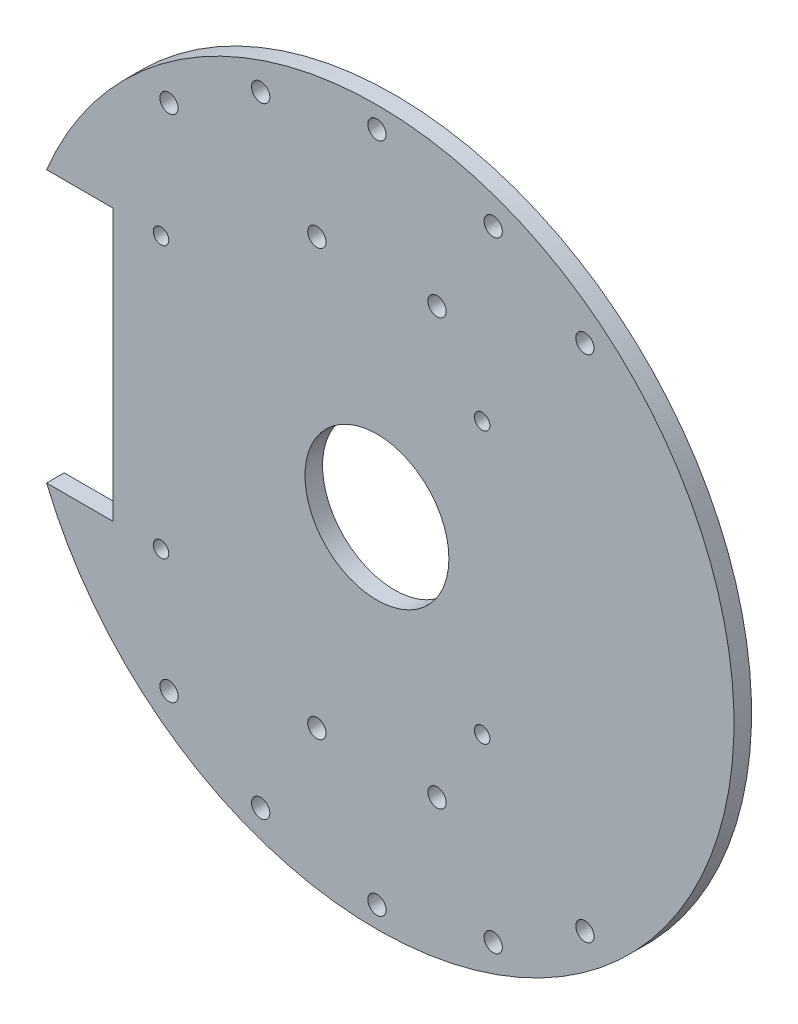
ISO-10303-21;
HEADER;
FILE_DESCRIPTION(('STEP AP214'),'2;1');
FILE_NAME('part.step','',(''),(''),'','','');
FILE_SCHEMA(('AUTOMOTIVE_DESIGN { 1 0 10303 214 1 1 1 1 }'));
ENDSEC;
DATA;
#1=APPLICATION_CONTEXT('core data for automotive mechanical design processes');
#2=APPLICATION_PROTOCOL_DEFINITION('international standard','automotive_design',2000,#1);
#3=PRODUCT_CONTEXT('',#1,'mechanical');
#4=PRODUCT('Part','Part','',(#3));
#5=PRODUCT_RELATED_PRODUCT_CATEGORY('part','',(#4));
#6=PRODUCT_DEFINITION_FORMATION('','',#4);
#7=PRODUCT_DEFINITION_CONTEXT('part definition',#1,'design');
#8=PRODUCT_DEFINITION('design','',#6,#7);
#9=PRODUCT_DEFINITION_SHAPE('','',#8);
#10=(LENGTH_UNIT() NAMED_UNIT(*) SI_UNIT(.MILLI.,.METRE.));
#11=(NAMED_UNIT(*) PLANE_ANGLE_UNIT() SI_UNIT($,.RADIAN.));
#12=(NAMED_UNIT(*) SI_UNIT($,.STERADIAN.) SOLID_ANGLE_UNIT());
#13=UNCERTAINTY_MEASURE_WITH_UNIT(LENGTH_MEASURE(1.E-05),#10,'distance_accuracy_value','');
#14=(GEOMETRIC_REPRESENTATION_CONTEXT(3) GLOBAL_UNCERTAINTY_ASSIGNED_CONTEXT((#13)) GLOBAL_UNIT_ASSIGNED_CONTEXT((#10,
#11,#12)) REPRESENTATION_CONTEXT('',''));
#15=CARTESIAN_POINT('',(0.,0.,0.));
#16=DIRECTION('',(0.,0.,1.));
#17=DIRECTION('',(1.,0.,0.));
#18=AXIS2_PLACEMENT_3D('',#15,#16,#17);
#19=CARTESIAN_POINT('',(-15.1685965380731,-0.366425757688035,3.175));
#20=DIRECTION('',(0.,0.,1.));
#21=DIRECTION('',(1.,0.,0.));
#22=AXIS2_PLACEMENT_3D('',#19,#20,#21);
#23=PLANE('',#22);
#24=DIRECTION('',(-1.,0.,0.));
#25=VECTOR('',#24,1.);
#26=CARTESIAN_POINT('',(-74.8343320987782,24.1335742423121,3.175));
#27=LINE('',#26,#25);
#28=CARTESIAN_POINT('',(-62.8343320987782,24.1335742423121,3.175));
#29=VERTEX_POINT('',#28);
#30=CARTESIAN_POINT('',(-74.8343320987782,24.1335742423121,3.175));
#31=VERTEX_POINT('',#30);
#32=EDGE_CURVE('E73',#29,#31,#27,.T.);
#33=ORIENTED_EDGE('',*,*,#32,.F.);
#34=DIRECTION('',(0.,1.,0.));
#35=VECTOR('',#34,1.);
#36=CARTESIAN_POINT('',(-62.8343320987782,24.1335742423121,3.175));
#37=LINE('',#36,#35);
#38=CARTESIAN_POINT('',(-62.8343320987782,-24.8664257576879,3.175));
#39=VERTEX_POINT('',#38);
#40=EDGE_CURVE('E97',#39,#29,#37,.T.);
#41=ORIENTED_EDGE('',*,*,#40,.F.);
#42=DIRECTION('',(1.,0.,0.));
#43=VECTOR('',#42,1.);
#44=CARTESIAN_POINT('',(-62.8343320987782,-24.8664257576879,3.175));
#45=LINE('',#44,#43);
#46=CARTESIAN_POINT('',(-74.8343320987784,-24.8664257576879,3.175));
#47=VERTEX_POINT('',#46);
#48=EDGE_CURVE('E79',#47,#39,#45,.T.);
#49=ORIENTED_EDGE('',*,*,#48,.F.);
#50=CARTESIAN_POINT('',(-15.1685965380731,-0.366425757688035,3.175));
#51=DIRECTION('',(0.,0.,1.));
#52=DIRECTION('',(1.,0.,0.));
#53=AXIS2_PLACEMENT_3D('',#50,#51,#52);
#54=CIRCLE('',#53,64.5);
#55=EDGE_CURVE('E11',#47,#31,#54,.T.);
#56=ORIENTED_EDGE('',*,*,#55,.T.);
#57=EDGE_LOOP('',(#33,#41,#49,#56));
#58=FACE_BOUND('',#57,.T.);
#59=CARTESIAN_POINT('',(5.83140346192693,55.633574242312,3.175));
#60=DIRECTION('',(0.,0.,1.));
#61=DIRECTION('',(-1.,0.,0.));
#62=AXIS2_PLACEMENT_3D('',#59,#60,#61);
#63=CIRCLE('',#62,1.65);
#64=CARTESIAN_POINT('',(4.18140346192693,55.633574242312,3.175));
#65=VERTEX_POINT('',#64);
#66=EDGE_CURVE('E113',#65,#65,#63,.T.);
#67=ORIENTED_EDGE('',*,*,#66,.F.);
#68=EDGE_LOOP('',(#67));
#69=FACE_BOUND('',#68,.T.);
#70=CARTESIAN_POINT('',(-52.7320677335862,45.6335742423119,3.175));
#71=DIRECTION('',(0.,0.,1.));
#72=DIRECTION('',(1.,0.,0.));
#73=AXIS2_PLACEMENT_3D('',#70,#71,#72);
#74=CIRCLE('',#73,1.65);
#75=CARTESIAN_POINT('',(-51.0820677335862,45.6335742423119,3.175));
#76=VERTEX_POINT('',#75);
#77=EDGE_CURVE('E125',#76,#76,#74,.T.);
#78=ORIENTED_EDGE('',*,*,#77,.F.);
#79=EDGE_LOOP('',(#78));
#80=FACE_BOUND('',#79,.T.);
#81=CARTESIAN_POINT('',(-4.31859653807309,38.058574242312,3.175));
#82=DIRECTION('',(0.,0.,1.));
#83=DIRECTION('',(-1.,0.,0.));
#84=AXIS2_PLACEMENT_3D('',#81,#82,#83);
#85=CIRCLE('',#84,1.65);
#86=CARTESIAN_POINT('',(-5.96859653807309,38.058574242312,3.175));
#87=VERTEX_POINT('',#86);
#88=EDGE_CURVE('E137',#87,#87,#85,.T.);
#89=ORIENTED_EDGE('',*,*,#88,.F.);
#90=EDGE_LOOP('',(#89));
#91=FACE_BOUND('',#90,.T.);
#92=CARTESIAN_POINT('',(-15.1685965380731,60.2835742423119,3.175));
#93=DIRECTION('',(0.,0.,1.));
#94=DIRECTION('',(-1.,0.,0.));
#95=AXIS2_PLACEMENT_3D('',#92,#93,#94);
#96=CIRCLE('',#95,1.65);
#97=CARTESIAN_POINT('',(-16.8185965380731,60.2835742423119,3.175));
#98=VERTEX_POINT('',#97);
#99=EDGE_CURVE('E149',#98,#98,#96,.T.);
#100=ORIENTED_EDGE('',*,*,#99,.F.);
#101=EDGE_LOOP('',(#100));
#102=FACE_BOUND('',#101,.T.);
#103=CARTESIAN_POINT('',(3.83140346192678,24.1335742423121,3.175));
#104=DIRECTION('',(0.,0.,1.));
#105=DIRECTION('',(1.,0.,0.));
#106=AXIS2_PLACEMENT_3D('',#103,#104,#105);
#107=CIRCLE('',#106,1.4);
#108=CARTESIAN_POINT('',(5.23140346192678,24.1335742423121,3.175));
#109=VERTEX_POINT('',#108);
#110=EDGE_CURVE('E161',#109,#109,#107,.T.);
#111=ORIENTED_EDGE('',*,*,#110,.F.);
#112=EDGE_LOOP('',(#111));
#113=FACE_BOUND('',#112,.T.);
#114=CARTESIAN_POINT('',(-36.1685965380731,-56.366425757688,3.175));
#115=DIRECTION('',(0.,0.,1.));
#116=DIRECTION('',(-1.,0.,0.));
#117=AXIS2_PLACEMENT_3D('',#114,#115,#116);
#118=CIRCLE('',#117,1.65);
#119=CARTESIAN_POINT('',(-37.8185965380731,-56.366425757688,3.175));
#120=VERTEX_POINT('',#119);
#121=EDGE_CURVE('E173',#120,#120,#118,.T.);
#122=ORIENTED_EDGE('',*,*,#121,.F.);
#123=EDGE_LOOP('',(#122));
#124=FACE_BOUND('',#123,.T.);
#125=CARTESIAN_POINT('',(-54.1685965380731,-24.8664257576881,3.175));
#126=DIRECTION('',(0.,0.,1.));
#127=DIRECTION('',(1.,0.,0.));
#128=AXIS2_PLACEMENT_3D('',#125,#126,#127);
#129=CIRCLE('',#128,1.4);
#130=CARTESIAN_POINT('',(-52.7685965380731,-24.8664257576881,3.175));
#131=VERTEX_POINT('',#130);
#132=EDGE_CURVE('E185',#131,#131,#129,.T.);
#133=ORIENTED_EDGE('',*,*,#132,.F.);
#134=EDGE_LOOP('',(#133));
#135=FACE_BOUND('',#134,.T.);
#136=CARTESIAN_POINT('',(-54.1685965380731,24.1335742423121,3.175));
#137=DIRECTION('',(0.,0.,1.));
#138=DIRECTION('',(1.,0.,0.));
#139=AXIS2_PLACEMENT_3D('',#136,#137,#138);
#140=CIRCLE('',#139,1.4);
#141=CARTESIAN_POINT('',(-52.7685965380731,24.1335742423121,3.175));
#142=VERTEX_POINT('',#141);
#143=EDGE_CURVE('E197',#142,#142,#140,.T.);
#144=ORIENTED_EDGE('',*,*,#143,.F.);
#145=EDGE_LOOP('',(#144));
#146=FACE_BOUND('',#145,.T.);
#147=CARTESIAN_POINT('',(-4.31859653807308,-38.7914257576881,3.175));
#148=DIRECTION('',(0.,0.,1.));
#149=DIRECTION('',(1.,0.,0.));
#150=AXIS2_PLACEMENT_3D('',#147,#148,#149);
#151=CIRCLE('',#150,1.65);
#152=CARTESIAN_POINT('',(-2.66859653807308,-38.7914257576881,3.175));
#153=VERTEX_POINT('',#152);
#154=EDGE_CURVE('E209',#153,#153,#151,.T.);
#155=ORIENTED_EDGE('',*,*,#154,.F.);
#156=EDGE_LOOP('',(#155));
#157=FACE_BOUND('',#156,.T.);
#158=CARTESIAN_POINT('',(-15.1685965380731,-0.366425757688035,3.175));
#159=DIRECTION('',(0.,0.,1.));
#160=DIRECTION('',(1.,0.,0.));
#161=AXIS2_PLACEMENT_3D('',#158,#159,#160);
#162=CIRCLE('',#161,13.);
#163=CARTESIAN_POINT('',(-2.16859653807308,-0.366425757688035,3.175));
#164=VERTEX_POINT('',#163);
#165=EDGE_CURVE('E215',#164,#164,#162,.T.);
#166=ORIENTED_EDGE('',*,*,#165,.F.);
#167=EDGE_LOOP('',(#166));
#168=FACE_BOUND('',#167,.T.);
#169=CARTESIAN_POINT('',(-15.1685965380731,-61.016425757688,3.175));
#170=DIRECTION('',(0.,0.,1.));
#171=DIRECTION('',(1.,0.,0.));
#172=AXIS2_PLACEMENT_3D('',#169,#170,#171);
#173=CIRCLE('',#172,1.65);
#174=CARTESIAN_POINT('',(-13.5185965380731,-61.016425757688,3.175));
#175=VERTEX_POINT('',#174);
#176=EDGE_CURVE('E203',#175,#175,#173,.T.);
#177=ORIENTED_EDGE('',*,*,#176,.F.);
#178=EDGE_LOOP('',(#177));
#179=FACE_BOUND('',#178,.T.);
#180=CARTESIAN_POINT('',(22.3948746574401,-46.366425757688,3.175));
#181=DIRECTION('',(0.,0.,1.));
#182=DIRECTION('',(1.,0.,0.));
#183=AXIS2_PLACEMENT_3D('',#180,#181,#182);
#184=CIRCLE('',#183,1.65);
#185=CARTESIAN_POINT('',(24.0448746574401,-46.366425757688,3.175));
#186=VERTEX_POINT('',#185);
#187=EDGE_CURVE('E191',#186,#186,#184,.T.);
#188=ORIENTED_EDGE('',*,*,#187,.F.);
#189=EDGE_LOOP('',(#188));
#190=FACE_BOUND('',#189,.T.);
#191=CARTESIAN_POINT('',(-26.0185965380731,-38.791425757688,3.175));
#192=DIRECTION('',(0.,0.,1.));
#193=DIRECTION('',(1.,0.,0.));
#194=AXIS2_PLACEMENT_3D('',#191,#192,#193);
#195=CIRCLE('',#194,1.65000000000001);
#196=CARTESIAN_POINT('',(-24.3685965380731,-38.791425757688,3.175));
#197=VERTEX_POINT('',#196);
#198=EDGE_CURVE('E179',#197,#197,#195,.T.);
#199=ORIENTED_EDGE('',*,*,#198,.F.);
#200=EDGE_LOOP('',(#199));
#201=FACE_BOUND('',#200,.T.);
#202=CARTESIAN_POINT('',(-52.7320677335862,-46.366425757688,3.175));
#203=DIRECTION('',(0.,0.,1.));
#204=DIRECTION('',(-1.,0.,0.));
#205=AXIS2_PLACEMENT_3D('',#202,#203,#204);
#206=CIRCLE('',#205,1.65);
#207=CARTESIAN_POINT('',(-54.3820677335862,-46.366425757688,3.175));
#208=VERTEX_POINT('',#207);
#209=EDGE_CURVE('E167',#208,#208,#206,.T.);
#210=ORIENTED_EDGE('',*,*,#209,.F.);
#211=EDGE_LOOP('',(#210));
#212=FACE_BOUND('',#211,.T.);
#213=CARTESIAN_POINT('',(3.83140346192679,-24.8664257576881,3.175));
#214=DIRECTION('',(0.,0.,1.));
#215=DIRECTION('',(1.,0.,0.));
#216=AXIS2_PLACEMENT_3D('',#213,#214,#215);
#217=CIRCLE('',#216,1.4);
#218=CARTESIAN_POINT('',(5.23140346192678,-24.8664257576881,3.175));
#219=VERTEX_POINT('',#218);
#220=EDGE_CURVE('E155',#219,#219,#217,.T.);
#221=ORIENTED_EDGE('',*,*,#220,.F.);
#222=EDGE_LOOP('',(#221));
#223=FACE_BOUND('',#222,.T.);
#224=CARTESIAN_POINT('',(-26.0185965380731,38.0585742423119,3.175));
#225=DIRECTION('',(0.,0.,1.));
#226=DIRECTION('',(-1.,0.,0.));
#227=AXIS2_PLACEMENT_3D('',#224,#225,#226);
#228=CIRCLE('',#227,1.65000000000001);
#229=CARTESIAN_POINT('',(-27.6685965380731,38.0585742423119,3.175));
#230=VERTEX_POINT('',#229);
#231=EDGE_CURVE('E143',#230,#230,#228,.T.);
#232=ORIENTED_EDGE('',*,*,#231,.F.);
#233=EDGE_LOOP('',(#232));
#234=FACE_BOUND('',#233,.T.);
#235=CARTESIAN_POINT('',(5.83140346192694,-56.366425757688,3.175));
#236=DIRECTION('',(0.,0.,1.));
#237=DIRECTION('',(1.,0.,0.));
#238=AXIS2_PLACEMENT_3D('',#235,#236,#237);
#239=CIRCLE('',#238,1.65);
#240=CARTESIAN_POINT('',(7.48140346192694,-56.366425757688,3.175));
#241=VERTEX_POINT('',#240);
#242=EDGE_CURVE('E131',#241,#241,#239,.T.);
#243=ORIENTED_EDGE('',*,*,#242,.F.);
#244=EDGE_LOOP('',(#243));
#245=FACE_BOUND('',#244,.T.);
#246=CARTESIAN_POINT('',(-36.1685965380731,55.633574242312,3.175));
#247=DIRECTION('',(0.,0.,1.));
#248=DIRECTION('',(1.,0.,0.));
#249=AXIS2_PLACEMENT_3D('',#246,#247,#248);
#250=CIRCLE('',#249,1.65);
#251=CARTESIAN_POINT('',(-34.5185965380731,55.633574242312,3.175));
#252=VERTEX_POINT('',#251);
#253=EDGE_CURVE('E119',#252,#252,#250,.T.);
#254=ORIENTED_EDGE('',*,*,#253,.F.);
#255=EDGE_LOOP('',(#254));
#256=FACE_BOUND('',#255,.T.);
#257=CARTESIAN_POINT('',(22.39487465744,45.633574242312,3.175));
#258=DIRECTION('',(0.,0.,1.));
#259=DIRECTION('',(-1.,0.,0.));
#260=AXIS2_PLACEMENT_3D('',#257,#258,#259);
#261=CIRCLE('',#260,1.65);
#262=CARTESIAN_POINT('',(20.74487465744,45.633574242312,3.175));
#263=VERTEX_POINT('',#262);
#264=EDGE_CURVE('E107',#263,#263,#261,.T.);
#265=ORIENTED_EDGE('',*,*,#264,.F.);
#266=EDGE_LOOP('',(#265));
#267=FACE_BOUND('',#266,.T.);
#268=ADVANCED_FACE('F33',(#58,#69,#80,#91,#102,#113,#124,#135,#146,#157,#168,#179,#190,#201,
#212,#223,#234,#245,#256,#267),#23,.T.);
#269=CARTESIAN_POINT('',(-15.1685965380731,-0.366425757688035,0.));
#270=DIRECTION('',(0.,0.,1.));
#271=DIRECTION('',(1.,0.,0.));
#272=AXIS2_PLACEMENT_3D('',#269,#270,#271);
#273=PLANE('',#272);
#274=DIRECTION('',(0.,1.,0.));
#275=VECTOR('',#274,1.);
#276=CARTESIAN_POINT('',(-62.8343320987782,24.1335742423121,0.));
#277=LINE('',#276,#275);
#278=CARTESIAN_POINT('',(-62.8343320987782,-24.8664257576879,0.));
#279=VERTEX_POINT('',#278);
#280=CARTESIAN_POINT('',(-62.8343320987782,24.1335742423121,0.));
#281=VERTEX_POINT('',#280);
#282=EDGE_CURVE('E87',#279,#281,#277,.T.);
#283=ORIENTED_EDGE('',*,*,#282,.T.);
#284=DIRECTION('',(-1.,0.,0.));
#285=VECTOR('',#284,1.);
#286=CARTESIAN_POINT('',(-74.8343320987782,24.1335742423121,0.));
#287=LINE('',#286,#285);
#288=CARTESIAN_POINT('',(-74.8343320987782,24.1335742423121,0.));
#289=VERTEX_POINT('',#288);
#290=EDGE_CURVE('E90',#281,#289,#287,.T.);
#291=ORIENTED_EDGE('',*,*,#290,.T.);
#292=CARTESIAN_POINT('',(-15.1685965380731,-0.366425757688035,0.));
#293=DIRECTION('',(0.,0.,1.));
#294=DIRECTION('',(1.,0.,0.));
#295=AXIS2_PLACEMENT_3D('',#292,#293,#294);
#296=CIRCLE('',#295,64.5);
#297=CARTESIAN_POINT('',(-74.8343320987784,-24.8664257576879,0.));
#298=VERTEX_POINT('',#297);
#299=EDGE_CURVE('E37',#298,#289,#296,.T.);
#300=ORIENTED_EDGE('',*,*,#299,.F.);
#301=DIRECTION('',(1.,0.,0.));
#302=VECTOR('',#301,1.);
#303=CARTESIAN_POINT('',(-62.8343320987782,-24.8664257576879,0.));
#304=LINE('',#303,#302);
#305=EDGE_CURVE('E48',#298,#279,#304,.T.);
#306=ORIENTED_EDGE('',*,*,#305,.T.);
#307=EDGE_LOOP('',(#283,#291,#300,#306));
#308=FACE_BOUND('',#307,.T.);
#309=CARTESIAN_POINT('',(-15.1685965380731,-0.366425757688035,0.));
#310=DIRECTION('',(0.,0.,1.));
#311=DIRECTION('',(1.,0.,0.));
#312=AXIS2_PLACEMENT_3D('',#309,#310,#311);
#313=CIRCLE('',#312,13.);
#314=CARTESIAN_POINT('',(-2.16859653807308,-0.366425757688035,0.));
#315=VERTEX_POINT('',#314);
#316=EDGE_CURVE('E212',#315,#315,#313,.T.);
#317=ORIENTED_EDGE('',*,*,#316,.T.);
#318=EDGE_LOOP('',(#317));
#319=FACE_BOUND('',#318,.T.);
#320=CARTESIAN_POINT('',(-4.31859653807308,-38.7914257576881,0.));
#321=DIRECTION('',(0.,0.,1.));
#322=DIRECTION('',(1.,0.,0.));
#323=AXIS2_PLACEMENT_3D('',#320,#321,#322);
#324=CIRCLE('',#323,1.65);
#325=CARTESIAN_POINT('',(-2.66859653807308,-38.7914257576881,0.));
#326=VERTEX_POINT('',#325);
#327=EDGE_CURVE('E206',#326,#326,#324,.T.);
#328=ORIENTED_EDGE('',*,*,#327,.T.);
#329=EDGE_LOOP('',(#328));
#330=FACE_BOUND('',#329,.T.);
#331=CARTESIAN_POINT('',(-15.1685965380731,-61.016425757688,0.));
#332=DIRECTION('',(0.,0.,1.));
#333=DIRECTION('',(1.,0.,0.));
#334=AXIS2_PLACEMENT_3D('',#331,#332,#333);
#335=CIRCLE('',#334,1.65);
#336=CARTESIAN_POINT('',(-13.5185965380731,-61.016425757688,0.));
#337=VERTEX_POINT('',#336);
#338=EDGE_CURVE('E200',#337,#337,#335,.T.);
#339=ORIENTED_EDGE('',*,*,#338,.T.);
#340=EDGE_LOOP('',(#339));
#341=FACE_BOUND('',#340,.T.);
#342=CARTESIAN_POINT('',(-54.1685965380731,24.1335742423121,0.));
#343=DIRECTION('',(0.,0.,1.));
#344=DIRECTION('',(1.,0.,0.));
#345=AXIS2_PLACEMENT_3D('',#342,#343,#344);
#346=CIRCLE('',#345,1.4);
#347=CARTESIAN_POINT('',(-52.7685965380731,24.1335742423121,0.));
#348=VERTEX_POINT('',#347);
#349=EDGE_CURVE('E194',#348,#348,#346,.T.);
#350=ORIENTED_EDGE('',*,*,#349,.T.);
#351=EDGE_LOOP('',(#350));
#352=FACE_BOUND('',#351,.T.);
#353=CARTESIAN_POINT('',(22.3948746574401,-46.366425757688,0.));
#354=DIRECTION('',(0.,0.,1.));
#355=DIRECTION('',(1.,0.,0.));
#356=AXIS2_PLACEMENT_3D('',#353,#354,#355);
#357=CIRCLE('',#356,1.65);
#358=CARTESIAN_POINT('',(24.0448746574401,-46.366425757688,0.));
#359=VERTEX_POINT('',#358);
#360=EDGE_CURVE('E188',#359,#359,#357,.T.);
#361=ORIENTED_EDGE('',*,*,#360,.T.);
#362=EDGE_LOOP('',(#361));
#363=FACE_BOUND('',#362,.T.);
#364=CARTESIAN_POINT('',(-54.1685965380731,-24.8664257576881,0.));
#365=DIRECTION('',(0.,0.,1.));
#366=DIRECTION('',(1.,0.,0.));
#367=AXIS2_PLACEMENT_3D('',#364,#365,#366);
#368=CIRCLE('',#367,1.4);
#369=CARTESIAN_POINT('',(-52.7685965380731,-24.8664257576881,0.));
#370=VERTEX_POINT('',#369);
#371=EDGE_CURVE('E182',#370,#370,#368,.T.);
#372=ORIENTED_EDGE('',*,*,#371,.T.);
#373=EDGE_LOOP('',(#372));
#374=FACE_BOUND('',#373,.T.);
#375=CARTESIAN_POINT('',(-26.0185965380731,-38.791425757688,0.));
#376=DIRECTION('',(0.,0.,1.));
#377=DIRECTION('',(1.,0.,0.));
#378=AXIS2_PLACEMENT_3D('',#375,#376,#377);
#379=CIRCLE('',#378,1.65000000000001);
#380=CARTESIAN_POINT('',(-24.3685965380731,-38.791425757688,0.));
#381=VERTEX_POINT('',#380);
#382=EDGE_CURVE('E176',#381,#381,#379,.T.);
#383=ORIENTED_EDGE('',*,*,#382,.T.);
#384=EDGE_LOOP('',(#383));
#385=FACE_BOUND('',#384,.T.);
#386=CARTESIAN_POINT('',(-36.1685965380731,-56.366425757688,0.));
#387=DIRECTION('',(0.,0.,1.));
#388=DIRECTION('',(-1.,0.,0.));
#389=AXIS2_PLACEMENT_3D('',#386,#387,#388);
#390=CIRCLE('',#389,1.65);
#391=CARTESIAN_POINT('',(-37.8185965380731,-56.366425757688,0.));
#392=VERTEX_POINT('',#391);
#393=EDGE_CURVE('E170',#392,#392,#390,.T.);
#394=ORIENTED_EDGE('',*,*,#393,.T.);
#395=EDGE_LOOP('',(#394));
#396=FACE_BOUND('',#395,.T.);
#397=CARTESIAN_POINT('',(-52.7320677335862,-46.366425757688,0.));
#398=DIRECTION('',(0.,0.,1.));
#399=DIRECTION('',(-1.,0.,0.));
#400=AXIS2_PLACEMENT_3D('',#397,#398,#399);
#401=CIRCLE('',#400,1.65);
#402=CARTESIAN_POINT('',(-54.3820677335862,-46.366425757688,0.));
#403=VERTEX_POINT('',#402);
#404=EDGE_CURVE('E164',#403,#403,#401,.T.);
#405=ORIENTED_EDGE('',*,*,#404,.T.);
#406=EDGE_LOOP('',(#405));
#407=FACE_BOUND('',#406,.T.);
#408=CARTESIAN_POINT('',(3.83140346192678,24.1335742423121,0.));
#409=DIRECTION('',(0.,0.,1.));
#410=DIRECTION('',(1.,0.,0.));
#411=AXIS2_PLACEMENT_3D('',#408,#409,#410);
#412=CIRCLE('',#411,1.4);
#413=CARTESIAN_POINT('',(5.23140346192678,24.1335742423121,0.));
#414=VERTEX_POINT('',#413);
#415=EDGE_CURVE('E158',#414,#414,#412,.T.);
#416=ORIENTED_EDGE('',*,*,#415,.T.);
#417=EDGE_LOOP('',(#416));
#418=FACE_BOUND('',#417,.T.);
#419=CARTESIAN_POINT('',(3.83140346192679,-24.8664257576881,0.));
#420=DIRECTION('',(0.,0.,1.));
#421=DIRECTION('',(1.,0.,0.));
#422=AXIS2_PLACEMENT_3D('',#419,#420,#421);
#423=CIRCLE('',#422,1.4);
#424=CARTESIAN_POINT('',(5.23140346192678,-24.8664257576881,0.));
#425=VERTEX_POINT('',#424);
#426=EDGE_CURVE('E152',#425,#425,#423,.T.);
#427=ORIENTED_EDGE('',*,*,#426,.T.);
#428=EDGE_LOOP('',(#427));
#429=FACE_BOUND('',#428,.T.);
#430=CARTESIAN_POINT('',(-15.1685965380731,60.2835742423119,0.));
#431=DIRECTION('',(0.,0.,1.));
#432=DIRECTION('',(-1.,0.,0.));
#433=AXIS2_PLACEMENT_3D('',#430,#431,#432);
#434=CIRCLE('',#433,1.65);
#435=CARTESIAN_POINT('',(-16.8185965380731,60.2835742423119,0.));
#436=VERTEX_POINT('',#435);
#437=EDGE_CURVE('E146',#436,#436,#434,.T.);
#438=ORIENTED_EDGE('',*,*,#437,.T.);
#439=EDGE_LOOP('',(#438));
#440=FACE_BOUND('',#439,.T.);
#441=CARTESIAN_POINT('',(-26.0185965380731,38.0585742423119,0.));
#442=DIRECTION('',(0.,0.,1.));
#443=DIRECTION('',(-1.,0.,0.));
#444=AXIS2_PLACEMENT_3D('',#441,#442,#443);
#445=CIRCLE('',#444,1.65000000000001);
#446=CARTESIAN_POINT('',(-27.6685965380731,38.0585742423119,0.));
#447=VERTEX_POINT('',#446);
#448=EDGE_CURVE('E140',#447,#447,#445,.T.);
#449=ORIENTED_EDGE('',*,*,#448,.T.);
#450=EDGE_LOOP('',(#449));
#451=FACE_BOUND('',#450,.T.);
#452=CARTESIAN_POINT('',(-4.31859653807309,38.058574242312,0.));
#453=DIRECTION('',(0.,0.,1.));
#454=DIRECTION('',(-1.,0.,0.));
#455=AXIS2_PLACEMENT_3D('',#452,#453,#454);
#456=CIRCLE('',#455,1.65);
#457=CARTESIAN_POINT('',(-5.96859653807309,38.058574242312,0.));
#458=VERTEX_POINT('',#457);
#459=EDGE_CURVE('E134',#458,#458,#456,.T.);
#460=ORIENTED_EDGE('',*,*,#459,.T.);
#461=EDGE_LOOP('',(#460));
#462=FACE_BOUND('',#461,.T.);
#463=CARTESIAN_POINT('',(5.83140346192694,-56.366425757688,0.));
#464=DIRECTION('',(0.,0.,1.));
#465=DIRECTION('',(1.,0.,0.));
#466=AXIS2_PLACEMENT_3D('',#463,#464,#465);
#467=CIRCLE('',#466,1.65);
#468=CARTESIAN_POINT('',(7.48140346192694,-56.366425757688,0.));
#469=VERTEX_POINT('',#468);
#470=EDGE_CURVE('E128',#469,#469,#467,.T.);
#471=ORIENTED_EDGE('',*,*,#470,.T.);
#472=EDGE_LOOP('',(#471));
#473=FACE_BOUND('',#472,.T.);
#474=CARTESIAN_POINT('',(-52.7320677335862,45.6335742423119,0.));
#475=DIRECTION('',(0.,0.,1.));
#476=DIRECTION('',(1.,0.,0.));
#477=AXIS2_PLACEMENT_3D('',#474,#475,#476);
#478=CIRCLE('',#477,1.65);
#479=CARTESIAN_POINT('',(-51.0820677335862,45.6335742423119,0.));
#480=VERTEX_POINT('',#479);
#481=EDGE_CURVE('E122',#480,#480,#478,.T.);
#482=ORIENTED_EDGE('',*,*,#481,.T.);
#483=EDGE_LOOP('',(#482));
#484=FACE_BOUND('',#483,.T.);
#485=CARTESIAN_POINT('',(-36.1685965380731,55.633574242312,0.));
#486=DIRECTION('',(0.,0.,1.));
#487=DIRECTION('',(1.,0.,0.));
#488=AXIS2_PLACEMENT_3D('',#485,#486,#487);
#489=CIRCLE('',#488,1.65);
#490=CARTESIAN_POINT('',(-34.5185965380731,55.633574242312,0.));
#491=VERTEX_POINT('',#490);
#492=EDGE_CURVE('E116',#491,#491,#489,.T.);
#493=ORIENTED_EDGE('',*,*,#492,.T.);
#494=EDGE_LOOP('',(#493));
#495=FACE_BOUND('',#494,.T.);
#496=CARTESIAN_POINT('',(5.83140346192693,55.633574242312,0.));
#497=DIRECTION('',(0.,0.,1.));
#498=DIRECTION('',(-1.,0.,0.));
#499=AXIS2_PLACEMENT_3D('',#496,#497,#498);
#500=CIRCLE('',#499,1.65);
#501=CARTESIAN_POINT('',(4.18140346192693,55.633574242312,0.));
#502=VERTEX_POINT('',#501);
#503=EDGE_CURVE('E110',#502,#502,#500,.T.);
#504=ORIENTED_EDGE('',*,*,#503,.T.);
#505=EDGE_LOOP('',(#504));
#506=FACE_BOUND('',#505,.T.);
#507=CARTESIAN_POINT('',(22.39487465744,45.633574242312,0.));
#508=DIRECTION('',(0.,0.,1.));
#509=DIRECTION('',(-1.,0.,0.));
#510=AXIS2_PLACEMENT_3D('',#507,#508,#509);
#511=CIRCLE('',#510,1.65);
#512=CARTESIAN_POINT('',(20.74487465744,45.633574242312,0.));
#513=VERTEX_POINT('',#512);
#514=EDGE_CURVE('E104',#513,#513,#511,.T.);
#515=ORIENTED_EDGE('',*,*,#514,.T.);
#516=EDGE_LOOP('',(#515));
#517=FACE_BOUND('',#516,.T.);
#518=ADVANCED_FACE('F93',(#308,#319,#330,#341,#352,#363,#374,#385,#396,#407,#418,#429,#440,#451,
#462,#473,#484,#495,#506,#517),#273,.F.);
#519=CARTESIAN_POINT('',(-15.1685965380731,-0.366425757688035,3.175));
#520=DIRECTION('',(0.,0.,-1.));
#521=DIRECTION('',(-1.,0.,0.));
#522=AXIS2_PLACEMENT_3D('',#519,#520,#521);
#523=CYLINDRICAL_SURFACE('',#522,64.5);
#524=ORIENTED_EDGE('',*,*,#299,.T.);
#525=DIRECTION('',(0.,0.,1.));
#526=VECTOR('',#525,1.);
#527=CARTESIAN_POINT('',(-74.8343320987782,24.1335742423121,0.));
#528=LINE('',#527,#526);
#529=EDGE_CURVE('E57',#289,#31,#528,.T.);
#530=ORIENTED_EDGE('',*,*,#529,.T.);
#531=ORIENTED_EDGE('',*,*,#55,.F.);
#532=DIRECTION('',(0.,0.,1.));
#533=VECTOR('',#532,1.);
#534=CARTESIAN_POINT('',(-74.8343320987784,-24.8664257576879,0.));
#535=LINE('',#534,#533);
#536=EDGE_CURVE('E84',#298,#47,#535,.T.);
#537=ORIENTED_EDGE('',*,*,#536,.F.);
#538=EDGE_LOOP('',(#524,#530,#531,#537));
#539=FACE_BOUND('',#538,.T.);
#540=ADVANCED_FACE('F35',(#539),#523,.T.);
#541=CARTESIAN_POINT('',(-15.1685965380731,-0.366425757688035,3.175));
#542=DIRECTION('',(0.,0.,-1.));
#543=DIRECTION('',(-1.,0.,0.));
#544=AXIS2_PLACEMENT_3D('',#541,#542,#543);
#545=CYLINDRICAL_SURFACE('',#544,13.);
#546=ORIENTED_EDGE('',*,*,#165,.T.);
#547=EDGE_LOOP('',(#546));
#548=FACE_BOUND('',#547,.T.);
#549=ORIENTED_EDGE('',*,*,#316,.F.);
#550=EDGE_LOOP('',(#549));
#551=FACE_BOUND('',#550,.T.);
#552=ADVANCED_FACE('F222',(#548,#551),#545,.F.);
#553=CARTESIAN_POINT('',(-4.31859653807308,-38.7914257576881,3.175));
#554=DIRECTION('',(0.,0.,-1.));
#555=DIRECTION('',(-1.,0.,0.));
#556=AXIS2_PLACEMENT_3D('',#553,#554,#555);
#557=CYLINDRICAL_SURFACE('',#556,1.65);
#558=ORIENTED_EDGE('',*,*,#154,.T.);
#559=EDGE_LOOP('',(#558));
#560=FACE_BOUND('',#559,.T.);
#561=ORIENTED_EDGE('',*,*,#327,.F.);
#562=EDGE_LOOP('',(#561));
#563=FACE_BOUND('',#562,.T.);
#564=ADVANCED_FACE('F224',(#560,#563),#557,.F.);
#565=CARTESIAN_POINT('',(-15.1685965380731,-61.016425757688,3.175));
#566=DIRECTION('',(0.,0.,-1.));
#567=DIRECTION('',(-1.,0.,0.));
#568=AXIS2_PLACEMENT_3D('',#565,#566,#567);
#569=CYLINDRICAL_SURFACE('',#568,1.65);
#570=ORIENTED_EDGE('',*,*,#176,.T.);
#571=EDGE_LOOP('',(#570));
#572=FACE_BOUND('',#571,.T.);
#573=ORIENTED_EDGE('',*,*,#338,.F.);
#574=EDGE_LOOP('',(#573));
#575=FACE_BOUND('',#574,.T.);
#576=ADVANCED_FACE('F231',(#572,#575),#569,.F.);
#577=CARTESIAN_POINT('',(-54.1685965380731,24.1335742423121,3.175));
#578=DIRECTION('',(0.,0.,-1.));
#579=DIRECTION('',(-1.,0.,0.));
#580=AXIS2_PLACEMENT_3D('',#577,#578,#579);
#581=CYLINDRICAL_SURFACE('',#580,1.4);
#582=ORIENTED_EDGE('',*,*,#143,.T.);
#583=EDGE_LOOP('',(#582));
#584=FACE_BOUND('',#583,.T.);
#585=ORIENTED_EDGE('',*,*,#349,.F.);
#586=EDGE_LOOP('',(#585));
#587=FACE_BOUND('',#586,.T.);
#588=ADVANCED_FACE('F349',(#584,#587),#581,.F.);
#589=CARTESIAN_POINT('',(22.3948746574401,-46.366425757688,3.175));
#590=DIRECTION('',(0.,0.,-1.));
#591=DIRECTION('',(-1.,0.,0.));
#592=AXIS2_PLACEMENT_3D('',#589,#590,#591);
#593=CYLINDRICAL_SURFACE('',#592,1.65);
#594=ORIENTED_EDGE('',*,*,#187,.T.);
#595=EDGE_LOOP('',(#594));
#596=FACE_BOUND('',#595,.T.);
#597=ORIENTED_EDGE('',*,*,#360,.F.);
#598=EDGE_LOOP('',(#597));
#599=FACE_BOUND('',#598,.T.);
#600=ADVANCED_FACE('F345',(#596,#599),#593,.F.);
#601=CARTESIAN_POINT('',(-54.1685965380731,-24.8664257576881,3.175));
#602=DIRECTION('',(0.,0.,-1.));
#603=DIRECTION('',(-1.,0.,0.));
#604=AXIS2_PLACEMENT_3D('',#601,#602,#603);
#605=CYLINDRICAL_SURFACE('',#604,1.4);
#606=ORIENTED_EDGE('',*,*,#132,.T.);
#607=EDGE_LOOP('',(#606));
#608=FACE_BOUND('',#607,.T.);
#609=ORIENTED_EDGE('',*,*,#371,.F.);
#610=EDGE_LOOP('',(#609));
#611=FACE_BOUND('',#610,.T.);
#612=ADVANCED_FACE('F341',(#608,#611),#605,.F.);
#613=CARTESIAN_POINT('',(-26.0185965380731,-38.791425757688,3.175));
#614=DIRECTION('',(0.,0.,-1.));
#615=DIRECTION('',(-1.,0.,0.));
#616=AXIS2_PLACEMENT_3D('',#613,#614,#615);
#617=CYLINDRICAL_SURFACE('',#616,1.65000000000001);
#618=ORIENTED_EDGE('',*,*,#198,.T.);
#619=EDGE_LOOP('',(#618));
#620=FACE_BOUND('',#619,.T.);
#621=ORIENTED_EDGE('',*,*,#382,.F.);
#622=EDGE_LOOP('',(#621));
#623=FACE_BOUND('',#622,.T.);
#624=ADVANCED_FACE('F337',(#620,#623),#617,.F.);
#625=CARTESIAN_POINT('',(-36.1685965380731,-56.366425757688,3.175));
#626=DIRECTION('',(0.,0.,-1.));
#627=DIRECTION('',(-1.,0.,0.));
#628=AXIS2_PLACEMENT_3D('',#625,#626,#627);
#629=CYLINDRICAL_SURFACE('',#628,1.65);
#630=ORIENTED_EDGE('',*,*,#121,.T.);
#631=EDGE_LOOP('',(#630));
#632=FACE_BOUND('',#631,.T.);
#633=ORIENTED_EDGE('',*,*,#393,.F.);
#634=EDGE_LOOP('',(#633));
#635=FACE_BOUND('',#634,.T.);
#636=ADVANCED_FACE('F333',(#632,#635),#629,.F.);
#637=CARTESIAN_POINT('',(-52.7320677335862,-46.366425757688,3.175));
#638=DIRECTION('',(0.,0.,-1.));
#639=DIRECTION('',(-1.,0.,0.));
#640=AXIS2_PLACEMENT_3D('',#637,#638,#639);
#641=CYLINDRICAL_SURFACE('',#640,1.65);
#642=ORIENTED_EDGE('',*,*,#209,.T.);
#643=EDGE_LOOP('',(#642));
#644=FACE_BOUND('',#643,.T.);
#645=ORIENTED_EDGE('',*,*,#404,.F.);
#646=EDGE_LOOP('',(#645));
#647=FACE_BOUND('',#646,.T.);
#648=ADVANCED_FACE('F329',(#644,#647),#641,.F.);
#649=CARTESIAN_POINT('',(3.83140346192678,24.1335742423121,3.175));
#650=DIRECTION('',(0.,0.,-1.));
#651=DIRECTION('',(-1.,0.,0.));
#652=AXIS2_PLACEMENT_3D('',#649,#650,#651);
#653=CYLINDRICAL_SURFACE('',#652,1.4);
#654=ORIENTED_EDGE('',*,*,#110,.T.);
#655=EDGE_LOOP('',(#654));
#656=FACE_BOUND('',#655,.T.);
#657=ORIENTED_EDGE('',*,*,#415,.F.);
#658=EDGE_LOOP('',(#657));
#659=FACE_BOUND('',#658,.T.);
#660=ADVANCED_FACE('F325',(#656,#659),#653,.F.);
#661=CARTESIAN_POINT('',(3.83140346192679,-24.8664257576881,3.175));
#662=DIRECTION('',(0.,0.,-1.));
#663=DIRECTION('',(-1.,0.,0.));
#664=AXIS2_PLACEMENT_3D('',#661,#662,#663);
#665=CYLINDRICAL_SURFACE('',#664,1.4);
#666=ORIENTED_EDGE('',*,*,#220,.T.);
#667=EDGE_LOOP('',(#666));
#668=FACE_BOUND('',#667,.T.);
#669=ORIENTED_EDGE('',*,*,#426,.F.);
#670=EDGE_LOOP('',(#669));
#671=FACE_BOUND('',#670,.T.);
#672=ADVANCED_FACE('F321',(#668,#671),#665,.F.);
#673=CARTESIAN_POINT('',(-15.1685965380731,60.2835742423119,3.175));
#674=DIRECTION('',(0.,0.,-1.));
#675=DIRECTION('',(-1.,0.,0.));
#676=AXIS2_PLACEMENT_3D('',#673,#674,#675);
#677=CYLINDRICAL_SURFACE('',#676,1.65);
#678=ORIENTED_EDGE('',*,*,#99,.T.);
#679=EDGE_LOOP('',(#678));
#680=FACE_BOUND('',#679,.T.);
#681=ORIENTED_EDGE('',*,*,#437,.F.);
#682=EDGE_LOOP('',(#681));
#683=FACE_BOUND('',#682,.T.);
#684=ADVANCED_FACE('F317',(#680,#683),#677,.F.);
#685=CARTESIAN_POINT('',(-26.0185965380731,38.0585742423119,3.175));
#686=DIRECTION('',(0.,0.,-1.));
#687=DIRECTION('',(-1.,0.,0.));
#688=AXIS2_PLACEMENT_3D('',#685,#686,#687);
#689=CYLINDRICAL_SURFACE('',#688,1.65000000000001);
#690=ORIENTED_EDGE('',*,*,#231,.T.);
#691=EDGE_LOOP('',(#690));
#692=FACE_BOUND('',#691,.T.);
#693=ORIENTED_EDGE('',*,*,#448,.F.);
#694=EDGE_LOOP('',(#693));
#695=FACE_BOUND('',#694,.T.);
#696=ADVANCED_FACE('F313',(#692,#695),#689,.F.);
#697=CARTESIAN_POINT('',(-4.31859653807309,38.058574242312,3.175));
#698=DIRECTION('',(0.,0.,-1.));
#699=DIRECTION('',(-1.,0.,0.));
#700=AXIS2_PLACEMENT_3D('',#697,#698,#699);
#701=CYLINDRICAL_SURFACE('',#700,1.65);
#702=ORIENTED_EDGE('',*,*,#88,.T.);
#703=EDGE_LOOP('',(#702));
#704=FACE_BOUND('',#703,.T.);
#705=ORIENTED_EDGE('',*,*,#459,.F.);
#706=EDGE_LOOP('',(#705));
#707=FACE_BOUND('',#706,.T.);
#708=ADVANCED_FACE('F309',(#704,#707),#701,.F.);
#709=CARTESIAN_POINT('',(5.83140346192694,-56.366425757688,3.175));
#710=DIRECTION('',(0.,0.,-1.));
#711=DIRECTION('',(-1.,0.,0.));
#712=AXIS2_PLACEMENT_3D('',#709,#710,#711);
#713=CYLINDRICAL_SURFACE('',#712,1.65);
#714=ORIENTED_EDGE('',*,*,#242,.T.);
#715=EDGE_LOOP('',(#714));
#716=FACE_BOUND('',#715,.T.);
#717=ORIENTED_EDGE('',*,*,#470,.F.);
#718=EDGE_LOOP('',(#717));
#719=FACE_BOUND('',#718,.T.);
#720=ADVANCED_FACE('F305',(#716,#719),#713,.F.);
#721=CARTESIAN_POINT('',(-52.7320677335862,45.6335742423119,3.175));
#722=DIRECTION('',(0.,0.,-1.));
#723=DIRECTION('',(-1.,0.,0.));
#724=AXIS2_PLACEMENT_3D('',#721,#722,#723);
#725=CYLINDRICAL_SURFACE('',#724,1.65);
#726=ORIENTED_EDGE('',*,*,#77,.T.);
#727=EDGE_LOOP('',(#726));
#728=FACE_BOUND('',#727,.T.);
#729=ORIENTED_EDGE('',*,*,#481,.F.);
#730=EDGE_LOOP('',(#729));
#731=FACE_BOUND('',#730,.T.);
#732=ADVANCED_FACE('F301',(#728,#731),#725,.F.);
#733=CARTESIAN_POINT('',(-36.1685965380731,55.633574242312,3.175));
#734=DIRECTION('',(0.,0.,-1.));
#735=DIRECTION('',(-1.,0.,0.));
#736=AXIS2_PLACEMENT_3D('',#733,#734,#735);
#737=CYLINDRICAL_SURFACE('',#736,1.65);
#738=ORIENTED_EDGE('',*,*,#253,.T.);
#739=EDGE_LOOP('',(#738));
#740=FACE_BOUND('',#739,.T.);
#741=ORIENTED_EDGE('',*,*,#492,.F.);
#742=EDGE_LOOP('',(#741));
#743=FACE_BOUND('',#742,.T.);
#744=ADVANCED_FACE('F293',(#740,#743),#737,.F.);
#745=CARTESIAN_POINT('',(5.83140346192693,55.633574242312,3.175));
#746=DIRECTION('',(0.,0.,-1.));
#747=DIRECTION('',(-1.,0.,0.));
#748=AXIS2_PLACEMENT_3D('',#745,#746,#747);
#749=CYLINDRICAL_SURFACE('',#748,1.65);
#750=ORIENTED_EDGE('',*,*,#66,.T.);
#751=EDGE_LOOP('',(#750));
#752=FACE_BOUND('',#751,.T.);
#753=ORIENTED_EDGE('',*,*,#503,.F.);
#754=EDGE_LOOP('',(#753));
#755=FACE_BOUND('',#754,.T.);
#756=ADVANCED_FACE('F284',(#752,#755),#749,.F.);
#757=CARTESIAN_POINT('',(22.39487465744,45.633574242312,3.175));
#758=DIRECTION('',(0.,0.,-1.));
#759=DIRECTION('',(-1.,0.,0.));
#760=AXIS2_PLACEMENT_3D('',#757,#758,#759);
#761=CYLINDRICAL_SURFACE('',#760,1.65);
#762=ORIENTED_EDGE('',*,*,#264,.T.);
#763=EDGE_LOOP('',(#762));
#764=FACE_BOUND('',#763,.T.);
#765=ORIENTED_EDGE('',*,*,#514,.F.);
#766=EDGE_LOOP('',(#765));
#767=FACE_BOUND('',#766,.T.);
#768=ADVANCED_FACE('F280',(#764,#767),#761,.F.);
#769=CARTESIAN_POINT('',(-74.8343320987782,24.1335742423121,0.));
#770=DIRECTION('',(0.,1.,0.));
#771=DIRECTION('',(0.,0.,1.));
#772=AXIS2_PLACEMENT_3D('',#769,#770,#771);
#773=PLANE('',#772);
#774=ORIENTED_EDGE('',*,*,#32,.T.);
#775=ORIENTED_EDGE('',*,*,#529,.F.);
#776=ORIENTED_EDGE('',*,*,#290,.F.);
#777=DIRECTION('',(0.,0.,1.));
#778=VECTOR('',#777,1.);
#779=CARTESIAN_POINT('',(-62.8343320987782,24.1335742423121,0.));
#780=LINE('',#779,#778);
#781=EDGE_CURVE('E83',#281,#29,#780,.T.);
#782=ORIENTED_EDGE('',*,*,#781,.T.);
#783=EDGE_LOOP('',(#774,#775,#776,#782));
#784=FACE_BOUND('',#783,.T.);
#785=ADVANCED_FACE('F283',(#784),#773,.F.);
#786=CARTESIAN_POINT('',(-62.8343320987782,24.1335742423121,0.));
#787=DIRECTION('',(1.,0.,0.));
#788=DIRECTION('',(0.,0.,-1.));
#789=AXIS2_PLACEMENT_3D('',#786,#787,#788);
#790=PLANE('',#789);
#791=ORIENTED_EDGE('',*,*,#40,.T.);
#792=ORIENTED_EDGE('',*,*,#781,.F.);
#793=ORIENTED_EDGE('',*,*,#282,.F.);
#794=DIRECTION('',(0.,0.,1.));
#795=VECTOR('',#794,1.);
#796=CARTESIAN_POINT('',(-62.8343320987782,-24.8664257576879,0.));
#797=LINE('',#796,#795);
#798=EDGE_CURVE('E75',#279,#39,#797,.T.);
#799=ORIENTED_EDGE('',*,*,#798,.T.);
#800=EDGE_LOOP('',(#791,#792,#793,#799));
#801=FACE_BOUND('',#800,.T.);
#802=ADVANCED_FACE('F88',(#801),#790,.F.);
#803=CARTESIAN_POINT('',(-62.8343320987782,-24.8664257576879,0.));
#804=DIRECTION('',(0.,-1.,0.));
#805=DIRECTION('',(1.,0.,0.));
#806=AXIS2_PLACEMENT_3D('',#803,#804,#805);
#807=PLANE('',#806);
#808=ORIENTED_EDGE('',*,*,#48,.T.);
#809=ORIENTED_EDGE('',*,*,#798,.F.);
#810=ORIENTED_EDGE('',*,*,#305,.F.);
#811=ORIENTED_EDGE('',*,*,#536,.T.);
#812=EDGE_LOOP('',(#808,#809,#810,#811));
#813=FACE_BOUND('',#812,.T.);
#814=ADVANCED_FACE('F77',(#813),#807,.F.);
#815=CLOSED_SHELL('',(#268,#518,#540,#552,#564,#576,#588,#600,#612,#624,#636,#648,#660,#672,
#684,#696,#708,#720,#732,#744,#756,#768,#785,#802,#814));
#816=MANIFOLD_SOLID_BREP('B2',#815);
#817=ADVANCED_BREP_SHAPE_REPRESENTATION('',(#18,#816),#14);
#818=SHAPE_DEFINITION_REPRESENTATION(#9,#817);
ENDSEC;
END-ISO-10303-21;
